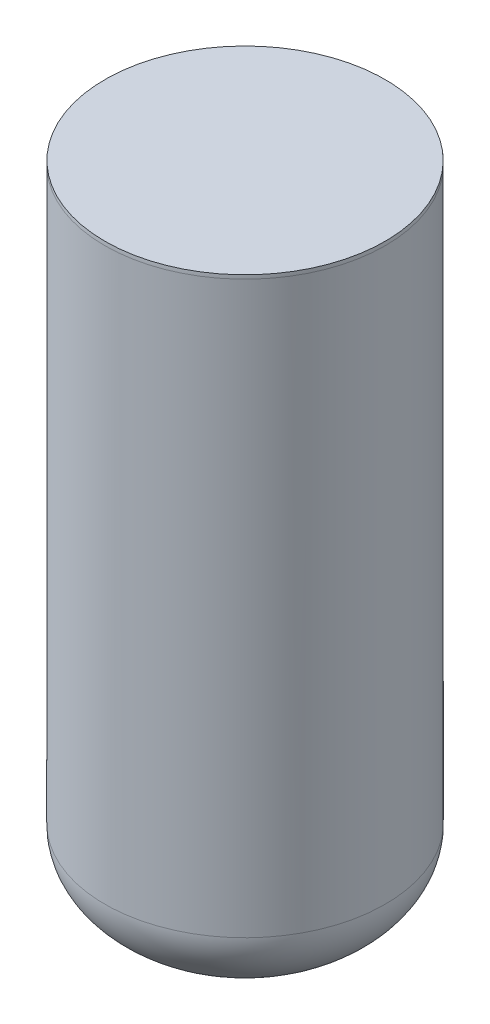
ISO-10303-21;
HEADER;
FILE_DESCRIPTION(('STEP AP214'),'2;1');
FILE_NAME('part.step','',(''),(''),'','','');
FILE_SCHEMA(('AUTOMOTIVE_DESIGN { 1 0 10303 214 1 1 1 1 }'));
ENDSEC;
DATA;
#1=APPLICATION_CONTEXT('core data for automotive mechanical design processes');
#2=APPLICATION_PROTOCOL_DEFINITION('international standard','automotive_design',2000,#1);
#3=PRODUCT_CONTEXT('',#1,'mechanical');
#4=PRODUCT('Part','Part','',(#3));
#5=PRODUCT_RELATED_PRODUCT_CATEGORY('part','',(#4));
#6=PRODUCT_DEFINITION_FORMATION('','',#4);
#7=PRODUCT_DEFINITION_CONTEXT('part definition',#1,'design');
#8=PRODUCT_DEFINITION('design','',#6,#7);
#9=PRODUCT_DEFINITION_SHAPE('','',#8);
#10=(LENGTH_UNIT() NAMED_UNIT(*) SI_UNIT(.MILLI.,.METRE.));
#11=(NAMED_UNIT(*) PLANE_ANGLE_UNIT() SI_UNIT($,.RADIAN.));
#12=(NAMED_UNIT(*) SI_UNIT($,.STERADIAN.) SOLID_ANGLE_UNIT());
#13=UNCERTAINTY_MEASURE_WITH_UNIT(LENGTH_MEASURE(1.E-05),#10,'distance_accuracy_value','');
#14=(GEOMETRIC_REPRESENTATION_CONTEXT(3) GLOBAL_UNCERTAINTY_ASSIGNED_CONTEXT((#13)) GLOBAL_UNIT_ASSIGNED_CONTEXT((#10,
#11,#12)) REPRESENTATION_CONTEXT('',''));
#15=CARTESIAN_POINT('',(0.,0.,0.));
#16=DIRECTION('',(0.,0.,1.));
#17=DIRECTION('',(1.,0.,0.));
#18=AXIS2_PLACEMENT_3D('',#15,#16,#17);
#19=CARTESIAN_POINT('',(0.,387.35,0.));
#20=DIRECTION('',(1.,0.,0.));
#21=DIRECTION('',(0.,0.,1.));
#22=AXIS2_PLACEMENT_3D('',#19,#20,#21);
#23=ELLIPSE('',#22,95.25,59.69);
#24=TRIMMED_CURVE('',#23,(PARAMETER_VALUE(1.5707963267949)),(PARAMETER_VALUE(4.71238898038469)),
.T.,.PARAMETER.);
#25=CARTESIAN_POINT('',(0.,447.04,0.));
#26=DIRECTION('',(0.,1.,0.));
#27=AXIS1_PLACEMENT('',#25,#26);
#28=SURFACE_OF_REVOLUTION('',#24,#27);
#29=CARTESIAN_POINT('',(0.,387.35,0.));
#30=DIRECTION('',(0.,1.,0.));
#31=DIRECTION('',(0.,0.,1.));
#32=AXIS2_PLACEMENT_3D('',#29,#30,#31);
#33=CIRCLE('',#32,95.25);
#34=CARTESIAN_POINT('',(0.,387.35,95.25));
#35=VERTEX_POINT('',#34);
#36=EDGE_CURVE('E11',#35,#35,#33,.T.);
#37=ORIENTED_EDGE('',*,*,#36,.T.);
#38=EDGE_LOOP('',(#37));
#39=FACE_BOUND('',#38,.T.);
#40=CARTESIAN_POINT('',(0.,389.89,0.));
#41=DIRECTION('',(0.,1.,0.));
#42=DIRECTION('',(0.,0.,1.));
#43=AXIS2_PLACEMENT_3D('',#40,#41,#42);
#44=CIRCLE('',#43,95.163722808382);
#45=CARTESIAN_POINT('',(0.,389.89,95.163722808382));
#46=VERTEX_POINT('',#45);
#47=EDGE_CURVE('E44',#46,#46,#44,.T.);
#48=ORIENTED_EDGE('',*,*,#47,.F.);
#49=EDGE_LOOP('',(#48));
#50=FACE_BOUND('',#49,.T.);
#51=ADVANCED_FACE('F40',(#39,#50),#28,.T.);
#52=CARTESIAN_POINT('',(0.,387.35,0.));
#53=DIRECTION('',(0.,-1.,0.));
#54=DIRECTION('',(0.,0.,-1.));
#55=AXIS2_PLACEMENT_3D('',#52,#53,#54);
#56=CYLINDRICAL_SURFACE('',#55,95.25);
#57=ORIENTED_EDGE('',*,*,#36,.F.);
#58=EDGE_LOOP('',(#57));
#59=FACE_BOUND('',#58,.T.);
#60=CARTESIAN_POINT('',(0.,0.,0.));
#61=DIRECTION('',(0.,-1.,0.));
#62=DIRECTION('',(0.,0.,-1.));
#63=AXIS2_PLACEMENT_3D('',#60,#61,#62);
#64=CIRCLE('',#63,95.25);
#65=CARTESIAN_POINT('',(0.,0.,-95.25));
#66=VERTEX_POINT('',#65);
#67=EDGE_CURVE('E48',#66,#66,#64,.T.);
#68=ORIENTED_EDGE('',*,*,#67,.F.);
#69=EDGE_LOOP('',(#68));
#70=FACE_BOUND('',#69,.T.);
#71=ADVANCED_FACE('F42',(#59,#70),#56,.T.);
#72=CARTESIAN_POINT('',(0.,0.,0.));
#73=DIRECTION('',(1.,0.,0.));
#74=DIRECTION('',(0.,0.,-1.));
#75=AXIS2_PLACEMENT_3D('',#72,#73,#74);
#76=ELLIPSE('',#75,95.25,61.214);
#77=TRIMMED_CURVE('',#76,(PARAMETER_VALUE(4.71238898038469)),
(PARAMETER_VALUE(7.85398163397448)),.T.,.PARAMETER.);
#78=CARTESIAN_POINT('',(0.,-61.214,0.));
#79=DIRECTION('',(0.,-1.,0.));
#80=AXIS1_PLACEMENT('',#78,#79);
#81=SURFACE_OF_REVOLUTION('',#77,#80);
#82=ORIENTED_EDGE('',*,*,#67,.T.);
#83=EDGE_LOOP('',(#82));
#84=FACE_BOUND('',#83,.T.);
#85=CARTESIAN_POINT('',(0.,-61.214,0.));
#86=VERTEX_POINT('',#85);
#87=VERTEX_LOOP('',#86);
#88=FACE_BOUND('',#87,.T.);
#89=ADVANCED_FACE('F51',(#84,#88),#81,.F.);
#90=CARTESIAN_POINT('',(0.,389.89,0.));
#91=DIRECTION('',(0.,1.,0.));
#92=DIRECTION('',(0.,0.,1.));
#93=AXIS2_PLACEMENT_3D('',#90,#91,#92);
#94=PLANE('',#93);
#95=ORIENTED_EDGE('',*,*,#47,.T.);
#96=EDGE_LOOP('',(#95));
#97=FACE_BOUND('',#96,.T.);
#98=ADVANCED_FACE('F53',(#97),#94,.T.);
#99=CLOSED_SHELL('',(#51,#71,#89,#98));
#100=MANIFOLD_SOLID_BREP('B2',#99);
#101=ADVANCED_BREP_SHAPE_REPRESENTATION('',(#18,#100),#14);
#102=SHAPE_DEFINITION_REPRESENTATION(#9,#101);
ENDSEC;
END-ISO-10303-21;
